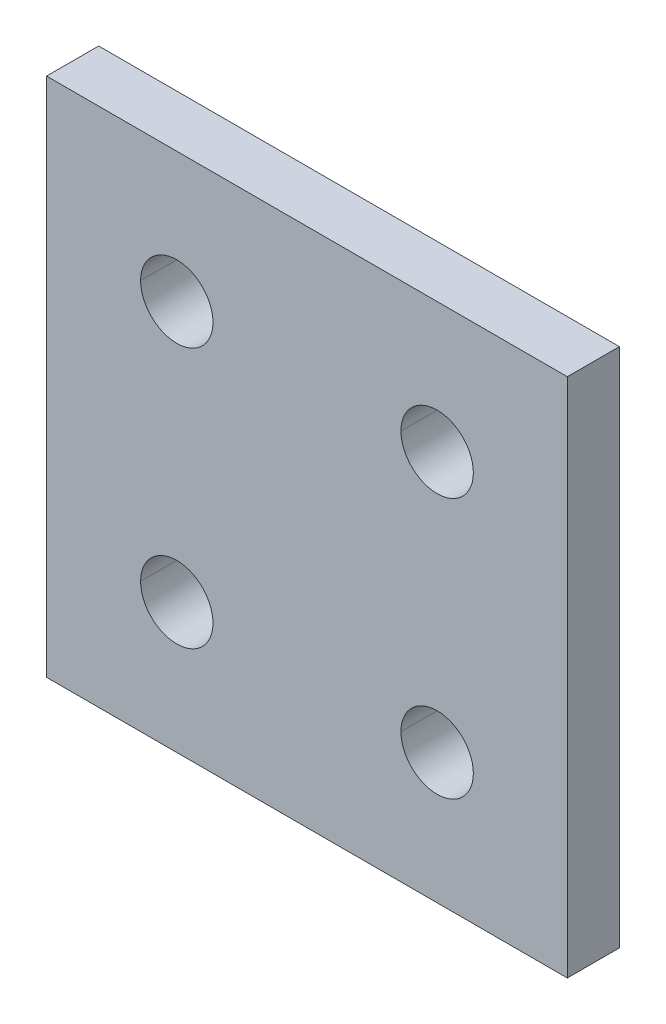
ISO-10303-21;
HEADER;
FILE_DESCRIPTION(('STEP AP214'),'2;1');
FILE_NAME('part.step','',(''),(''),'','','');
FILE_SCHEMA(('AUTOMOTIVE_DESIGN { 1 0 10303 214 1 1 1 1 }'));
ENDSEC;
DATA;
#1=APPLICATION_CONTEXT('core data for automotive mechanical design processes');
#2=APPLICATION_PROTOCOL_DEFINITION('international standard','automotive_design',2000,#1);
#3=PRODUCT_CONTEXT('',#1,'mechanical');
#4=PRODUCT('Part','Part','',(#3));
#5=PRODUCT_RELATED_PRODUCT_CATEGORY('part','',(#4));
#6=PRODUCT_DEFINITION_FORMATION('','',#4);
#7=PRODUCT_DEFINITION_CONTEXT('part definition',#1,'design');
#8=PRODUCT_DEFINITION('design','',#6,#7);
#9=PRODUCT_DEFINITION_SHAPE('','',#8);
#10=(LENGTH_UNIT() NAMED_UNIT(*) SI_UNIT(.MILLI.,.METRE.));
#11=(NAMED_UNIT(*) PLANE_ANGLE_UNIT() SI_UNIT($,.RADIAN.));
#12=(NAMED_UNIT(*) SI_UNIT($,.STERADIAN.) SOLID_ANGLE_UNIT());
#13=UNCERTAINTY_MEASURE_WITH_UNIT(LENGTH_MEASURE(1.E-05),#10,'distance_accuracy_value','');
#14=(GEOMETRIC_REPRESENTATION_CONTEXT(3) GLOBAL_UNCERTAINTY_ASSIGNED_CONTEXT((#13)) GLOBAL_UNIT_ASSIGNED_CONTEXT((#10,
#11,#12)) REPRESENTATION_CONTEXT('',''));
#15=CARTESIAN_POINT('',(0.,0.,0.));
#16=DIRECTION('',(0.,0.,1.));
#17=DIRECTION('',(1.,0.,0.));
#18=AXIS2_PLACEMENT_3D('',#15,#16,#17);
#19=CARTESIAN_POINT('',(20.,40.,4.));
#20=DIRECTION('',(0.,-1.,0.));
#21=DIRECTION('',(0.,0.,-1.));
#22=AXIS2_PLACEMENT_3D('',#19,#20,#21);
#23=PLANE('',#22);
#24=DIRECTION('',(-1.,0.,0.));
#25=VECTOR('',#24,1.);
#26=CARTESIAN_POINT('',(20.,40.,0.));
#27=LINE('',#26,#25);
#28=CARTESIAN_POINT('',(20.,40.,0.));
#29=VERTEX_POINT('',#28);
#30=CARTESIAN_POINT('',(-20.,40.,0.));
#31=VERTEX_POINT('',#30);
#32=EDGE_CURVE('E11',#29,#31,#27,.T.);
#33=ORIENTED_EDGE('',*,*,#32,.T.);
#34=DIRECTION('',(0.,0.,-1.));
#35=VECTOR('',#34,1.);
#36=CARTESIAN_POINT('',(-20.,40.,4.));
#37=LINE('',#36,#35);
#38=CARTESIAN_POINT('',(-20.,40.,4.));
#39=VERTEX_POINT('',#38);
#40=EDGE_CURVE('E24',#39,#31,#37,.T.);
#41=ORIENTED_EDGE('',*,*,#40,.F.);
#42=DIRECTION('',(-1.,0.,0.));
#43=VECTOR('',#42,1.);
#44=CARTESIAN_POINT('',(20.,40.,4.));
#45=LINE('',#44,#43);
#46=CARTESIAN_POINT('',(20.,40.,4.));
#47=VERTEX_POINT('',#46);
#48=EDGE_CURVE('E244',#47,#39,#45,.T.);
#49=ORIENTED_EDGE('',*,*,#48,.F.);
#50=DIRECTION('',(0.,0.,-1.));
#51=VECTOR('',#50,1.);
#52=CARTESIAN_POINT('',(20.,40.,4.));
#53=LINE('',#52,#51);
#54=EDGE_CURVE('E240',#47,#29,#53,.T.);
#55=ORIENTED_EDGE('',*,*,#54,.T.);
#56=EDGE_LOOP('',(#33,#41,#49,#55));
#57=FACE_BOUND('',#56,.T.);
#58=ADVANCED_FACE('F16',(#57),#23,.F.);
#59=CARTESIAN_POINT('',(20.,0.,4.));
#60=DIRECTION('',(-1.,0.,0.));
#61=DIRECTION('',(0.,0.,1.));
#62=AXIS2_PLACEMENT_3D('',#59,#60,#61);
#63=PLANE('',#62);
#64=DIRECTION('',(0.,1.,0.));
#65=VECTOR('',#64,1.);
#66=CARTESIAN_POINT('',(20.,0.,0.));
#67=LINE('',#66,#65);
#68=CARTESIAN_POINT('',(20.,0.,0.));
#69=VERTEX_POINT('',#68);
#70=EDGE_CURVE('E235',#69,#29,#67,.T.);
#71=ORIENTED_EDGE('',*,*,#70,.T.);
#72=ORIENTED_EDGE('',*,*,#54,.F.);
#73=DIRECTION('',(0.,1.,0.));
#74=VECTOR('',#73,1.);
#75=CARTESIAN_POINT('',(20.,0.,4.));
#76=LINE('',#75,#74);
#77=CARTESIAN_POINT('',(20.,0.,4.));
#78=VERTEX_POINT('',#77);
#79=EDGE_CURVE('E230',#78,#47,#76,.T.);
#80=ORIENTED_EDGE('',*,*,#79,.F.);
#81=DIRECTION('',(0.,0.,-1.));
#82=VECTOR('',#81,1.);
#83=CARTESIAN_POINT('',(20.,0.,4.));
#84=LINE('',#83,#82);
#85=EDGE_CURVE('E226',#78,#69,#84,.T.);
#86=ORIENTED_EDGE('',*,*,#85,.T.);
#87=EDGE_LOOP('',(#71,#72,#80,#86));
#88=FACE_BOUND('',#87,.T.);
#89=ADVANCED_FACE('F262',(#88),#63,.F.);
#90=CARTESIAN_POINT('',(-20.,0.,4.));
#91=DIRECTION('',(0.,1.,0.));
#92=DIRECTION('',(0.,0.,1.));
#93=AXIS2_PLACEMENT_3D('',#90,#91,#92);
#94=PLANE('',#93);
#95=DIRECTION('',(1.,0.,0.));
#96=VECTOR('',#95,1.);
#97=CARTESIAN_POINT('',(-20.,0.,0.));
#98=LINE('',#97,#96);
#99=CARTESIAN_POINT('',(-20.,0.,0.));
#100=VERTEX_POINT('',#99);
#101=EDGE_CURVE('E221',#100,#69,#98,.T.);
#102=ORIENTED_EDGE('',*,*,#101,.T.);
#103=ORIENTED_EDGE('',*,*,#85,.F.);
#104=DIRECTION('',(1.,0.,0.));
#105=VECTOR('',#104,1.);
#106=CARTESIAN_POINT('',(-20.,0.,4.));
#107=LINE('',#106,#105);
#108=CARTESIAN_POINT('',(-20.,0.,4.));
#109=VERTEX_POINT('',#108);
#110=EDGE_CURVE('E216',#109,#78,#107,.T.);
#111=ORIENTED_EDGE('',*,*,#110,.F.);
#112=DIRECTION('',(0.,0.,-1.));
#113=VECTOR('',#112,1.);
#114=CARTESIAN_POINT('',(-20.,0.,4.));
#115=LINE('',#114,#113);
#116=EDGE_CURVE('E212',#109,#100,#115,.T.);
#117=ORIENTED_EDGE('',*,*,#116,.T.);
#118=EDGE_LOOP('',(#102,#103,#111,#117));
#119=FACE_BOUND('',#118,.T.);
#120=ADVANCED_FACE('F266',(#119),#94,.F.);
#121=CARTESIAN_POINT('',(-20.,40.,4.));
#122=DIRECTION('',(1.,0.,0.));
#123=DIRECTION('',(0.,0.,-1.));
#124=AXIS2_PLACEMENT_3D('',#121,#122,#123);
#125=PLANE('',#124);
#126=DIRECTION('',(0.,-1.,0.));
#127=VECTOR('',#126,1.);
#128=CARTESIAN_POINT('',(-20.,40.,0.));
#129=LINE('',#128,#127);
#130=EDGE_CURVE('E207',#31,#100,#129,.T.);
#131=ORIENTED_EDGE('',*,*,#130,.T.);
#132=ORIENTED_EDGE('',*,*,#116,.F.);
#133=DIRECTION('',(0.,-1.,0.));
#134=VECTOR('',#133,1.);
#135=CARTESIAN_POINT('',(-20.,40.,4.));
#136=LINE('',#135,#134);
#137=EDGE_CURVE('E202',#39,#109,#136,.T.);
#138=ORIENTED_EDGE('',*,*,#137,.F.);
#139=ORIENTED_EDGE('',*,*,#40,.T.);
#140=EDGE_LOOP('',(#131,#132,#138,#139));
#141=FACE_BOUND('',#140,.T.);
#142=ADVANCED_FACE('F254',(#141),#125,.F.);
#143=CARTESIAN_POINT('',(0.,0.,4.));
#144=DIRECTION('',(0.,0.,1.));
#145=DIRECTION('',(1.,0.,0.));
#146=AXIS2_PLACEMENT_3D('',#143,#144,#145);
#147=PLANE('',#146);
#148=CARTESIAN_POINT('',(-10.,30.,4.));
#149=DIRECTION('',(0.,0.,1.));
#150=DIRECTION('',(1.,0.,0.));
#151=AXIS2_PLACEMENT_3D('',#148,#149,#150);
#152=CIRCLE('',#151,2.78);
#153=CARTESIAN_POINT('',(-12.78,30.,4.));
#154=VERTEX_POINT('',#153);
#155=CARTESIAN_POINT('',(-7.22,30.,4.));
#156=VERTEX_POINT('',#155);
#157=EDGE_CURVE('E197',#154,#156,#152,.T.);
#158=ORIENTED_EDGE('',*,*,#157,.F.);
#159=CARTESIAN_POINT('',(-10.,30.,4.));
#160=DIRECTION('',(0.,0.,1.));
#161=DIRECTION('',(1.,0.,0.));
#162=AXIS2_PLACEMENT_3D('',#159,#160,#161);
#163=CIRCLE('',#162,2.78);
#164=EDGE_CURVE('E192',#156,#154,#163,.T.);
#165=ORIENTED_EDGE('',*,*,#164,.F.);
#166=EDGE_LOOP('',(#158,#165));
#167=FACE_BOUND('',#166,.T.);
#168=CARTESIAN_POINT('',(-10.,10.,4.));
#169=DIRECTION('',(0.,0.,1.));
#170=DIRECTION('',(1.,0.,0.));
#171=AXIS2_PLACEMENT_3D('',#168,#169,#170);
#172=CIRCLE('',#171,2.78);
#173=CARTESIAN_POINT('',(-12.78,10.,4.));
#174=VERTEX_POINT('',#173);
#175=CARTESIAN_POINT('',(-7.22,10.,4.));
#176=VERTEX_POINT('',#175);
#177=EDGE_CURVE('E187',#174,#176,#172,.T.);
#178=ORIENTED_EDGE('',*,*,#177,.F.);
#179=CARTESIAN_POINT('',(-10.,10.,4.));
#180=DIRECTION('',(0.,0.,1.));
#181=DIRECTION('',(1.,0.,0.));
#182=AXIS2_PLACEMENT_3D('',#179,#180,#181);
#183=CIRCLE('',#182,2.78);
#184=EDGE_CURVE('E182',#176,#174,#183,.T.);
#185=ORIENTED_EDGE('',*,*,#184,.F.);
#186=EDGE_LOOP('',(#178,#185));
#187=FACE_BOUND('',#186,.T.);
#188=CARTESIAN_POINT('',(10.,30.,4.));
#189=DIRECTION('',(0.,0.,1.));
#190=DIRECTION('',(1.,0.,0.));
#191=AXIS2_PLACEMENT_3D('',#188,#189,#190);
#192=CIRCLE('',#191,2.78);
#193=CARTESIAN_POINT('',(7.22,30.,4.));
#194=VERTEX_POINT('',#193);
#195=CARTESIAN_POINT('',(12.78,30.,4.));
#196=VERTEX_POINT('',#195);
#197=EDGE_CURVE('E121',#194,#196,#192,.T.);
#198=ORIENTED_EDGE('',*,*,#197,.F.);
#199=CARTESIAN_POINT('',(10.,30.,4.));
#200=DIRECTION('',(0.,0.,1.));
#201=DIRECTION('',(1.,0.,0.));
#202=AXIS2_PLACEMENT_3D('',#199,#200,#201);
#203=CIRCLE('',#202,2.78);
#204=EDGE_CURVE('E175',#196,#194,#203,.T.);
#205=ORIENTED_EDGE('',*,*,#204,.F.);
#206=EDGE_LOOP('',(#198,#205));
#207=FACE_BOUND('',#206,.T.);
#208=CARTESIAN_POINT('',(10.,10.,4.));
#209=DIRECTION('',(0.,0.,1.));
#210=DIRECTION('',(1.,0.,0.));
#211=AXIS2_PLACEMENT_3D('',#208,#209,#210);
#212=CIRCLE('',#211,2.78);
#213=CARTESIAN_POINT('',(7.22,10.,4.));
#214=VERTEX_POINT('',#213);
#215=CARTESIAN_POINT('',(12.78,10.,4.));
#216=VERTEX_POINT('',#215);
#217=EDGE_CURVE('E170',#214,#216,#212,.T.);
#218=ORIENTED_EDGE('',*,*,#217,.F.);
#219=CARTESIAN_POINT('',(10.,10.,4.));
#220=DIRECTION('',(0.,0.,1.));
#221=DIRECTION('',(1.,0.,0.));
#222=AXIS2_PLACEMENT_3D('',#219,#220,#221);
#223=CIRCLE('',#222,2.78);
#224=EDGE_CURVE('E165',#216,#214,#223,.T.);
#225=ORIENTED_EDGE('',*,*,#224,.F.);
#226=EDGE_LOOP('',(#218,#225));
#227=FACE_BOUND('',#226,.T.);
#228=ORIENTED_EDGE('',*,*,#48,.T.);
#229=ORIENTED_EDGE('',*,*,#137,.T.);
#230=ORIENTED_EDGE('',*,*,#110,.T.);
#231=ORIENTED_EDGE('',*,*,#79,.T.);
#232=EDGE_LOOP('',(#228,#229,#230,#231));
#233=FACE_BOUND('',#232,.T.);
#234=ADVANCED_FACE('F258',(#167,#187,#207,#227,#233),#147,.T.);
#235=CARTESIAN_POINT('',(10.,10.,4.));
#236=DIRECTION('',(0.,0.,-1.));
#237=DIRECTION('',(0.,-1.,0.));
#238=AXIS2_PLACEMENT_3D('',#235,#236,#237);
#239=CYLINDRICAL_SURFACE('',#238,2.78);
#240=DIRECTION('',(0.,0.,-1.));
#241=VECTOR('',#240,1.);
#242=CARTESIAN_POINT('',(12.78,10.,4.));
#243=LINE('',#242,#241);
#244=CARTESIAN_POINT('',(12.78,10.,0.));
#245=VERTEX_POINT('',#244);
#246=EDGE_CURVE('E160',#216,#245,#243,.T.);
#247=ORIENTED_EDGE('',*,*,#246,.F.);
#248=ORIENTED_EDGE('',*,*,#224,.T.);
#249=DIRECTION('',(0.,0.,-1.));
#250=VECTOR('',#249,1.);
#251=CARTESIAN_POINT('',(7.22,10.,4.));
#252=LINE('',#251,#250);
#253=CARTESIAN_POINT('',(7.22,10.,0.));
#254=VERTEX_POINT('',#253);
#255=EDGE_CURVE('E156',#214,#254,#252,.T.);
#256=ORIENTED_EDGE('',*,*,#255,.T.);
#257=CARTESIAN_POINT('',(10.,10.,0.));
#258=DIRECTION('',(0.,0.,1.));
#259=DIRECTION('',(1.,0.,0.));
#260=AXIS2_PLACEMENT_3D('',#257,#258,#259);
#261=CIRCLE('',#260,2.78);
#262=EDGE_CURVE('E151',#245,#254,#261,.T.);
#263=ORIENTED_EDGE('',*,*,#262,.F.);
#264=EDGE_LOOP('',(#247,#248,#256,#263));
#265=FACE_BOUND('',#264,.T.);
#266=ADVANCED_FACE('F306',(#265),#239,.F.);
#267=CARTESIAN_POINT('',(0.,0.,0.));
#268=DIRECTION('',(0.,0.,1.));
#269=DIRECTION('',(1.,0.,0.));
#270=AXIS2_PLACEMENT_3D('',#267,#268,#269);
#271=PLANE('',#270);
#272=CARTESIAN_POINT('',(-10.,30.,0.));
#273=DIRECTION('',(0.,0.,1.));
#274=DIRECTION('',(1.,0.,0.));
#275=AXIS2_PLACEMENT_3D('',#272,#273,#274);
#276=CIRCLE('',#275,2.78);
#277=CARTESIAN_POINT('',(-7.22,30.,0.));
#278=VERTEX_POINT('',#277);
#279=CARTESIAN_POINT('',(-12.78,30.,0.));
#280=VERTEX_POINT('',#279);
#281=EDGE_CURVE('E147',#278,#280,#276,.T.);
#282=ORIENTED_EDGE('',*,*,#281,.T.);
#283=CARTESIAN_POINT('',(-10.,30.,0.));
#284=DIRECTION('',(0.,0.,1.));
#285=DIRECTION('',(1.,0.,0.));
#286=AXIS2_PLACEMENT_3D('',#283,#284,#285);
#287=CIRCLE('',#286,2.78);
#288=EDGE_CURVE('E143',#280,#278,#287,.T.);
#289=ORIENTED_EDGE('',*,*,#288,.T.);
#290=EDGE_LOOP('',(#282,#289));
#291=FACE_BOUND('',#290,.T.);
#292=CARTESIAN_POINT('',(-10.,10.,0.));
#293=DIRECTION('',(0.,0.,1.));
#294=DIRECTION('',(1.,0.,0.));
#295=AXIS2_PLACEMENT_3D('',#292,#293,#294);
#296=CIRCLE('',#295,2.78);
#297=CARTESIAN_POINT('',(-7.22,10.,0.));
#298=VERTEX_POINT('',#297);
#299=CARTESIAN_POINT('',(-12.78,10.,0.));
#300=VERTEX_POINT('',#299);
#301=EDGE_CURVE('E139',#298,#300,#296,.T.);
#302=ORIENTED_EDGE('',*,*,#301,.T.);
#303=CARTESIAN_POINT('',(-10.,10.,0.));
#304=DIRECTION('',(0.,0.,1.));
#305=DIRECTION('',(1.,0.,0.));
#306=AXIS2_PLACEMENT_3D('',#303,#304,#305);
#307=CIRCLE('',#306,2.78);
#308=EDGE_CURVE('E118',#300,#298,#307,.T.);
#309=ORIENTED_EDGE('',*,*,#308,.T.);
#310=EDGE_LOOP('',(#302,#309));
#311=FACE_BOUND('',#310,.T.);
#312=CARTESIAN_POINT('',(10.,30.,0.));
#313=DIRECTION('',(0.,0.,1.));
#314=DIRECTION('',(1.,0.,0.));
#315=AXIS2_PLACEMENT_3D('',#312,#313,#314);
#316=CIRCLE('',#315,2.78);
#317=CARTESIAN_POINT('',(12.78,30.,0.));
#318=VERTEX_POINT('',#317);
#319=CARTESIAN_POINT('',(7.22,30.,0.));
#320=VERTEX_POINT('',#319);
#321=EDGE_CURVE('E104',#318,#320,#316,.T.);
#322=ORIENTED_EDGE('',*,*,#321,.T.);
#323=CARTESIAN_POINT('',(10.,30.,0.));
#324=DIRECTION('',(0.,0.,1.));
#325=DIRECTION('',(1.,0.,0.));
#326=AXIS2_PLACEMENT_3D('',#323,#324,#325);
#327=CIRCLE('',#326,2.78);
#328=EDGE_CURVE('E100',#320,#318,#327,.T.);
#329=ORIENTED_EDGE('',*,*,#328,.T.);
#330=EDGE_LOOP('',(#322,#329));
#331=FACE_BOUND('',#330,.T.);
#332=ORIENTED_EDGE('',*,*,#262,.T.);
#333=CARTESIAN_POINT('',(10.,10.,0.));
#334=DIRECTION('',(0.,0.,1.));
#335=DIRECTION('',(1.,0.,0.));
#336=AXIS2_PLACEMENT_3D('',#333,#334,#335);
#337=CIRCLE('',#336,2.78);
#338=EDGE_CURVE('E109',#254,#245,#337,.T.);
#339=ORIENTED_EDGE('',*,*,#338,.T.);
#340=EDGE_LOOP('',(#332,#339));
#341=FACE_BOUND('',#340,.T.);
#342=ORIENTED_EDGE('',*,*,#32,.F.);
#343=ORIENTED_EDGE('',*,*,#70,.F.);
#344=ORIENTED_EDGE('',*,*,#101,.F.);
#345=ORIENTED_EDGE('',*,*,#130,.F.);
#346=EDGE_LOOP('',(#342,#343,#344,#345));
#347=FACE_BOUND('',#346,.T.);
#348=ADVANCED_FACE('F102',(#291,#311,#331,#341,#347),#271,.F.);
#349=CARTESIAN_POINT('',(10.,10.,4.));
#350=DIRECTION('',(0.,0.,-1.));
#351=DIRECTION('',(0.,1.,0.));
#352=AXIS2_PLACEMENT_3D('',#349,#350,#351);
#353=CYLINDRICAL_SURFACE('',#352,2.78);
#354=ORIENTED_EDGE('',*,*,#246,.T.);
#355=ORIENTED_EDGE('',*,*,#338,.F.);
#356=ORIENTED_EDGE('',*,*,#255,.F.);
#357=ORIENTED_EDGE('',*,*,#217,.T.);
#358=EDGE_LOOP('',(#354,#355,#356,#357));
#359=FACE_BOUND('',#358,.T.);
#360=ADVANCED_FACE('F325',(#359),#353,.F.);
#361=CARTESIAN_POINT('',(10.,30.,4.));
#362=DIRECTION('',(0.,0.,-1.));
#363=DIRECTION('',(0.,1.,0.));
#364=AXIS2_PLACEMENT_3D('',#361,#362,#363);
#365=CYLINDRICAL_SURFACE('',#364,2.78);
#366=DIRECTION('',(0.,0.,-1.));
#367=VECTOR('',#366,1.);
#368=CARTESIAN_POINT('',(12.78,30.,4.));
#369=LINE('',#368,#367);
#370=EDGE_CURVE('E115',#196,#318,#369,.T.);
#371=ORIENTED_EDGE('',*,*,#370,.T.);
#372=ORIENTED_EDGE('',*,*,#328,.F.);
#373=DIRECTION('',(0.,0.,-1.));
#374=VECTOR('',#373,1.);
#375=CARTESIAN_POINT('',(7.22,30.,4.));
#376=LINE('',#375,#374);
#377=EDGE_CURVE('E117',#194,#320,#376,.T.);
#378=ORIENTED_EDGE('',*,*,#377,.F.);
#379=ORIENTED_EDGE('',*,*,#197,.T.);
#380=EDGE_LOOP('',(#371,#372,#378,#379));
#381=FACE_BOUND('',#380,.T.);
#382=ADVANCED_FACE('F120',(#381),#365,.F.);
#383=CARTESIAN_POINT('',(10.,30.,4.));
#384=DIRECTION('',(0.,0.,-1.));
#385=DIRECTION('',(0.,-1.,0.));
#386=AXIS2_PLACEMENT_3D('',#383,#384,#385);
#387=CYLINDRICAL_SURFACE('',#386,2.78);
#388=ORIENTED_EDGE('',*,*,#370,.F.);
#389=ORIENTED_EDGE('',*,*,#204,.T.);
#390=ORIENTED_EDGE('',*,*,#377,.T.);
#391=ORIENTED_EDGE('',*,*,#321,.F.);
#392=EDGE_LOOP('',(#388,#389,#390,#391));
#393=FACE_BOUND('',#392,.T.);
#394=ADVANCED_FACE('F113',(#393),#387,.F.);
#395=CARTESIAN_POINT('',(-10.,10.,4.));
#396=DIRECTION('',(0.,0.,-1.));
#397=DIRECTION('',(0.,1.,0.));
#398=AXIS2_PLACEMENT_3D('',#395,#396,#397);
#399=CYLINDRICAL_SURFACE('',#398,2.78);
#400=DIRECTION('',(0.,0.,-1.));
#401=VECTOR('',#400,1.);
#402=CARTESIAN_POINT('',(-7.22,10.,4.));
#403=LINE('',#402,#401);
#404=EDGE_CURVE('E125',#176,#298,#403,.T.);
#405=ORIENTED_EDGE('',*,*,#404,.T.);
#406=ORIENTED_EDGE('',*,*,#308,.F.);
#407=DIRECTION('',(0.,0.,-1.));
#408=VECTOR('',#407,1.);
#409=CARTESIAN_POINT('',(-12.78,10.,4.));
#410=LINE('',#409,#408);
#411=EDGE_CURVE('E436',#174,#300,#410,.T.);
#412=ORIENTED_EDGE('',*,*,#411,.F.);
#413=ORIENTED_EDGE('',*,*,#177,.T.);
#414=EDGE_LOOP('',(#405,#406,#412,#413));
#415=FACE_BOUND('',#414,.T.);
#416=ADVANCED_FACE('F352',(#415),#399,.F.);
#417=CARTESIAN_POINT('',(-10.,10.,4.));
#418=DIRECTION('',(0.,0.,-1.));
#419=DIRECTION('',(0.,-1.,0.));
#420=AXIS2_PLACEMENT_3D('',#417,#418,#419);
#421=CYLINDRICAL_SURFACE('',#420,2.78);
#422=ORIENTED_EDGE('',*,*,#404,.F.);
#423=ORIENTED_EDGE('',*,*,#184,.T.);
#424=ORIENTED_EDGE('',*,*,#411,.T.);
#425=ORIENTED_EDGE('',*,*,#301,.F.);
#426=EDGE_LOOP('',(#422,#423,#424,#425));
#427=FACE_BOUND('',#426,.T.);
#428=ADVANCED_FACE('F361',(#427),#421,.F.);
#429=CARTESIAN_POINT('',(-10.,30.,4.));
#430=DIRECTION('',(0.,0.,-1.));
#431=DIRECTION('',(0.,1.,0.));
#432=AXIS2_PLACEMENT_3D('',#429,#430,#431);
#433=CYLINDRICAL_SURFACE('',#432,2.78);
#434=DIRECTION('',(0.,0.,-1.));
#435=VECTOR('',#434,1.);
#436=CARTESIAN_POINT('',(-7.22,30.,4.));
#437=LINE('',#436,#435);
#438=EDGE_CURVE('E433',#156,#278,#437,.T.);
#439=ORIENTED_EDGE('',*,*,#438,.T.);
#440=ORIENTED_EDGE('',*,*,#288,.F.);
#441=DIRECTION('',(0.,0.,-1.));
#442=VECTOR('',#441,1.);
#443=CARTESIAN_POINT('',(-12.78,30.,4.));
#444=LINE('',#443,#442);
#445=EDGE_CURVE('E437',#154,#280,#444,.T.);
#446=ORIENTED_EDGE('',*,*,#445,.F.);
#447=ORIENTED_EDGE('',*,*,#157,.T.);
#448=EDGE_LOOP('',(#439,#440,#446,#447));
#449=FACE_BOUND('',#448,.T.);
#450=ADVANCED_FACE('F371',(#449),#433,.F.);
#451=CARTESIAN_POINT('',(-10.,30.,4.));
#452=DIRECTION('',(0.,0.,-1.));
#453=DIRECTION('',(0.,-1.,0.));
#454=AXIS2_PLACEMENT_3D('',#451,#452,#453);
#455=CYLINDRICAL_SURFACE('',#454,2.78);
#456=ORIENTED_EDGE('',*,*,#438,.F.);
#457=ORIENTED_EDGE('',*,*,#164,.T.);
#458=ORIENTED_EDGE('',*,*,#445,.T.);
#459=ORIENTED_EDGE('',*,*,#281,.F.);
#460=EDGE_LOOP('',(#456,#457,#458,#459));
#461=FACE_BOUND('',#460,.T.);
#462=ADVANCED_FACE('F381',(#461),#455,.F.);
#463=CLOSED_SHELL('',(#58,#89,#120,#142,#234,#266,#348,#360,#382,#394,#416,#428,#450,#462));
#464=MANIFOLD_SOLID_BREP('B1',#463);
#465=ADVANCED_BREP_SHAPE_REPRESENTATION('',(#18,#464),#14);
#466=SHAPE_DEFINITION_REPRESENTATION(#9,#465);
ENDSEC;
END-ISO-10303-21;
